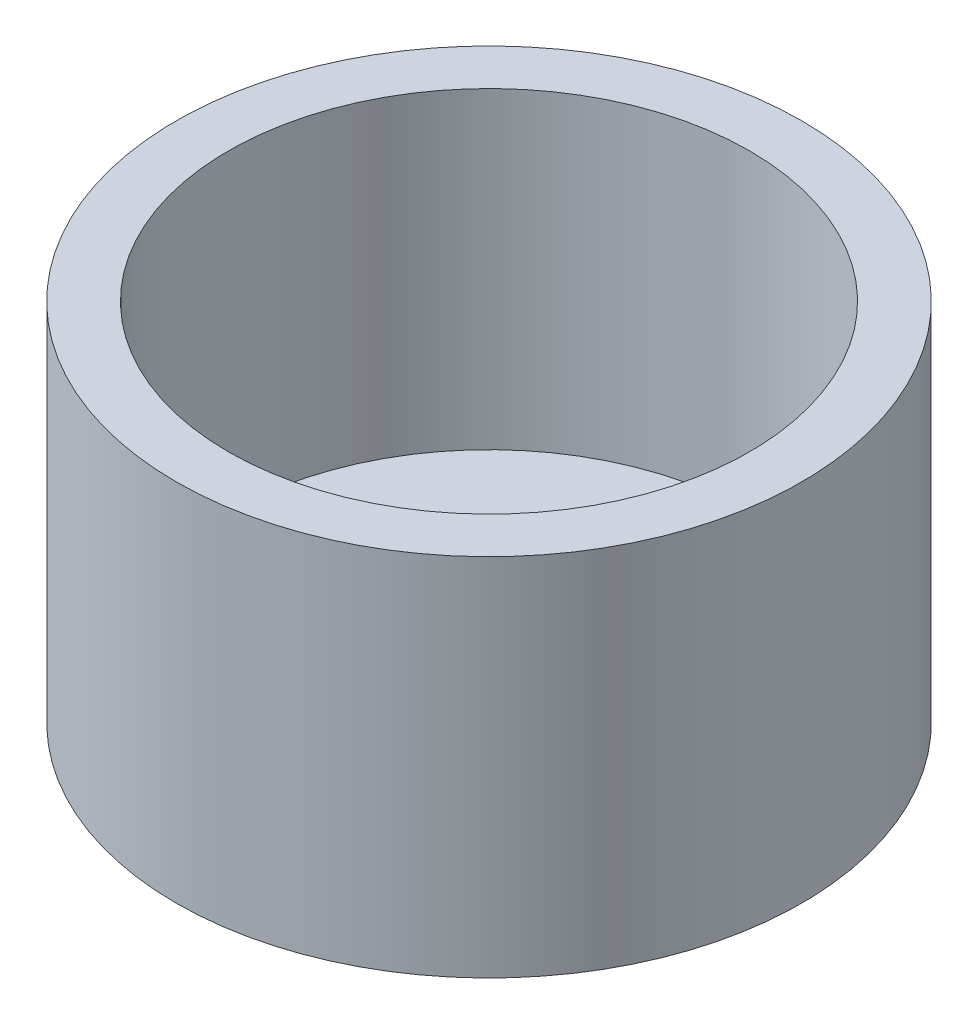
ISO-10303-21;
HEADER;
FILE_DESCRIPTION(('STEP AP214'),'2;1');
FILE_NAME('part.step','',(''),(''),'','','');
FILE_SCHEMA(('AUTOMOTIVE_DESIGN { 1 0 10303 214 1 1 1 1 }'));
ENDSEC;
DATA;
#1=APPLICATION_CONTEXT('core data for automotive mechanical design processes');
#2=APPLICATION_PROTOCOL_DEFINITION('international standard','automotive_design',2000,#1);
#3=PRODUCT_CONTEXT('',#1,'mechanical');
#4=PRODUCT('Part','Part','',(#3));
#5=PRODUCT_RELATED_PRODUCT_CATEGORY('part','',(#4));
#6=PRODUCT_DEFINITION_FORMATION('','',#4);
#7=PRODUCT_DEFINITION_CONTEXT('part definition',#1,'design');
#8=PRODUCT_DEFINITION('design','',#6,#7);
#9=PRODUCT_DEFINITION_SHAPE('','',#8);
#10=(LENGTH_UNIT() NAMED_UNIT(*) SI_UNIT(.MILLI.,.METRE.));
#11=(NAMED_UNIT(*) PLANE_ANGLE_UNIT() SI_UNIT($,.RADIAN.));
#12=(NAMED_UNIT(*) SI_UNIT($,.STERADIAN.) SOLID_ANGLE_UNIT());
#13=UNCERTAINTY_MEASURE_WITH_UNIT(LENGTH_MEASURE(1.E-05),#10,'distance_accuracy_value','');
#14=(GEOMETRIC_REPRESENTATION_CONTEXT(3) GLOBAL_UNCERTAINTY_ASSIGNED_CONTEXT((#13)) GLOBAL_UNIT_ASSIGNED_CONTEXT((#10,
#11,#12)) REPRESENTATION_CONTEXT('',''));
#15=CARTESIAN_POINT('',(0.,0.,0.));
#16=DIRECTION('',(0.,0.,1.));
#17=DIRECTION('',(1.,0.,0.));
#18=AXIS2_PLACEMENT_3D('',#15,#16,#17);
#19=CARTESIAN_POINT('',(-5.42511568942762,17.5,-4.3107043035555));
#20=DIRECTION('',(0.,-1.,0.));
#21=DIRECTION('',(0.,0.,-1.));
#22=AXIS2_PLACEMENT_3D('',#19,#20,#21);
#23=CYLINDRICAL_SURFACE('',#22,15.);
#24=CARTESIAN_POINT('',(-5.42511568942762,17.5,-4.3107043035555));
#25=DIRECTION('',(0.,1.,0.));
#26=DIRECTION('',(0.,0.,1.));
#27=AXIS2_PLACEMENT_3D('',#24,#25,#26);
#28=CIRCLE('',#27,15.);
#29=CARTESIAN_POINT('',(-5.42511568942762,17.5,10.6892956964445));
#30=VERTEX_POINT('',#29);
#31=EDGE_CURVE('E10',#30,#30,#28,.T.);
#32=ORIENTED_EDGE('',*,*,#31,.F.);
#33=EDGE_LOOP('',(#32));
#34=FACE_BOUND('',#33,.T.);
#35=CARTESIAN_POINT('',(-5.42511568942762,0.,-4.3107043035555));
#36=DIRECTION('',(0.,1.,0.));
#37=DIRECTION('',(0.,0.,1.));
#38=AXIS2_PLACEMENT_3D('',#35,#36,#37);
#39=CIRCLE('',#38,15.);
#40=CARTESIAN_POINT('',(-5.42511568942762,0.,10.6892956964445));
#41=VERTEX_POINT('',#40);
#42=EDGE_CURVE('E40',#41,#41,#39,.T.);
#43=ORIENTED_EDGE('',*,*,#42,.T.);
#44=EDGE_LOOP('',(#43));
#45=FACE_BOUND('',#44,.T.);
#46=ADVANCED_FACE('F37',(#34,#45),#23,.T.);
#47=CARTESIAN_POINT('',(-5.42511568942762,17.5,-4.3107043035555));
#48=DIRECTION('',(0.,1.,0.));
#49=DIRECTION('',(0.,0.,1.));
#50=AXIS2_PLACEMENT_3D('',#47,#48,#49);
#51=PLANE('',#50);
#52=CARTESIAN_POINT('',(-5.42511568942762,17.5,-4.3107043035555));
#53=DIRECTION('',(0.,1.,0.));
#54=DIRECTION('',(0.,0.,1.));
#55=AXIS2_PLACEMENT_3D('',#52,#53,#54);
#56=CIRCLE('',#55,12.5);
#57=CARTESIAN_POINT('',(-5.42511568942762,17.5,8.1892956964445));
#58=VERTEX_POINT('',#57);
#59=EDGE_CURVE('E51',#58,#58,#56,.T.);
#60=ORIENTED_EDGE('',*,*,#59,.F.);
#61=EDGE_LOOP('',(#60));
#62=FACE_BOUND('',#61,.T.);
#63=ORIENTED_EDGE('',*,*,#31,.T.);
#64=EDGE_LOOP('',(#63));
#65=FACE_BOUND('',#64,.T.);
#66=ADVANCED_FACE('F68',(#62,#65),#51,.T.);
#67=CARTESIAN_POINT('',(-5.42511568942762,0.,-4.3107043035555));
#68=DIRECTION('',(0.,1.,0.));
#69=DIRECTION('',(0.,0.,1.));
#70=AXIS2_PLACEMENT_3D('',#67,#68,#69);
#71=PLANE('',#70);
#72=ORIENTED_EDGE('',*,*,#42,.F.);
#73=EDGE_LOOP('',(#72));
#74=FACE_BOUND('',#73,.T.);
#75=ADVANCED_FACE('F64',(#74),#71,.F.);
#76=CARTESIAN_POINT('',(-5.42511568942762,2.5,-4.3107043035555));
#77=DIRECTION('',(0.,1.,0.));
#78=DIRECTION('',(0.,0.,1.));
#79=AXIS2_PLACEMENT_3D('',#76,#77,#78);
#80=CYLINDRICAL_SURFACE('',#79,12.5);
#81=CARTESIAN_POINT('',(-5.42511568942762,2.5,-4.3107043035555));
#82=DIRECTION('',(0.,1.,0.));
#83=DIRECTION('',(0.,0.,1.));
#84=AXIS2_PLACEMENT_3D('',#81,#82,#83);
#85=CIRCLE('',#84,12.5);
#86=CARTESIAN_POINT('',(-5.42511568942762,2.5,8.1892956964445));
#87=VERTEX_POINT('',#86);
#88=EDGE_CURVE('E49',#87,#87,#85,.T.);
#89=ORIENTED_EDGE('',*,*,#88,.F.);
#90=EDGE_LOOP('',(#89));
#91=FACE_BOUND('',#90,.T.);
#92=ORIENTED_EDGE('',*,*,#59,.T.);
#93=EDGE_LOOP('',(#92));
#94=FACE_BOUND('',#93,.T.);
#95=ADVANCED_FACE('F61',(#91,#94),#80,.F.);
#96=CARTESIAN_POINT('',(-5.42511568942762,2.5,-4.3107043035555));
#97=DIRECTION('',(0.,1.,0.));
#98=DIRECTION('',(0.,0.,1.));
#99=AXIS2_PLACEMENT_3D('',#96,#97,#98);
#100=PLANE('',#99);
#101=ORIENTED_EDGE('',*,*,#88,.T.);
#102=EDGE_LOOP('',(#101));
#103=FACE_BOUND('',#102,.T.);
#104=ADVANCED_FACE('F59',(#103),#100,.T.);
#105=CLOSED_SHELL('',(#46,#66,#75,#95,#104));
#106=MANIFOLD_SOLID_BREP('B2',#105);
#107=ADVANCED_BREP_SHAPE_REPRESENTATION('',(#18,#106),#14);
#108=SHAPE_DEFINITION_REPRESENTATION(#9,#107);
ENDSEC;
END-ISO-10303-21;
